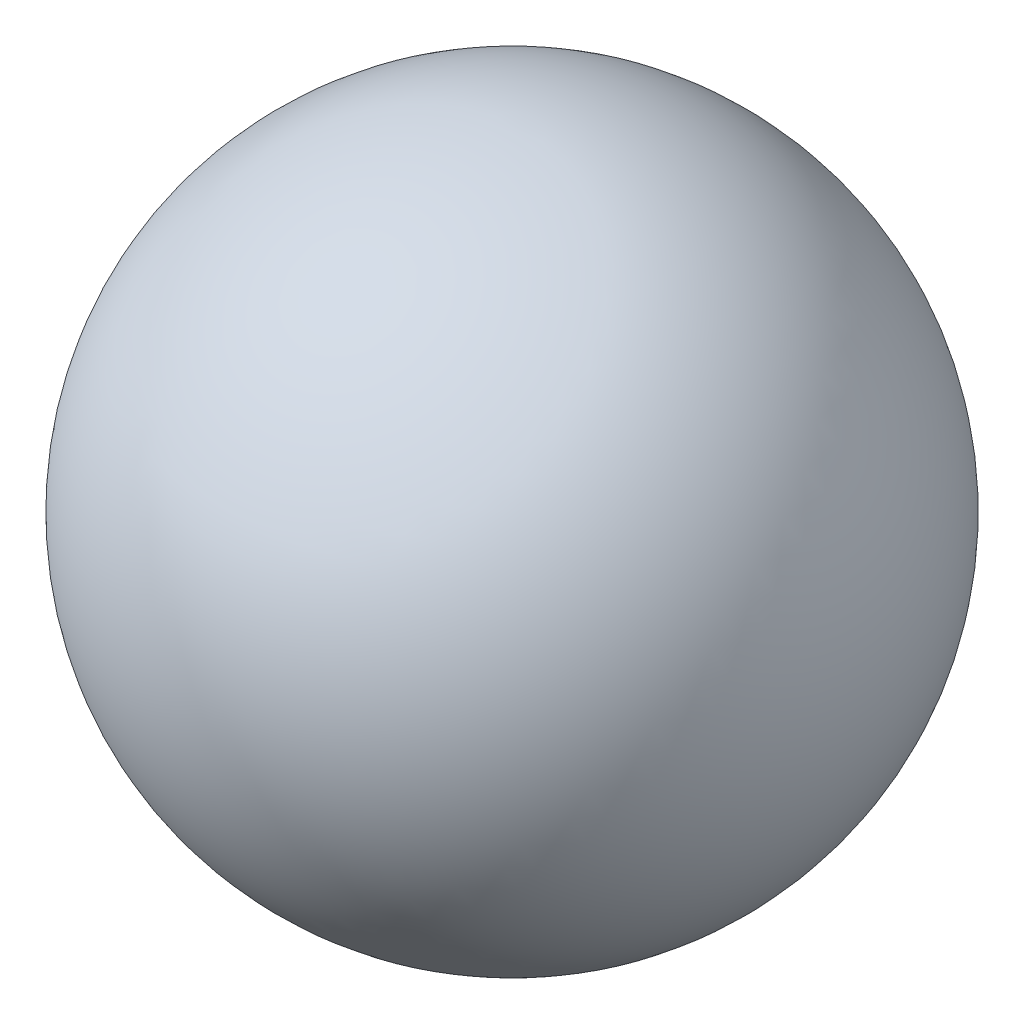
ISO-10303-21;
HEADER;
FILE_DESCRIPTION(('STEP AP214'),'2;1');
FILE_NAME('part.step','',(''),(''),'','','');
FILE_SCHEMA(('AUTOMOTIVE_DESIGN { 1 0 10303 214 1 1 1 1 }'));
ENDSEC;
DATA;
#1=APPLICATION_CONTEXT('core data for automotive mechanical design processes');
#2=APPLICATION_PROTOCOL_DEFINITION('international standard','automotive_design',2000,#1);
#3=PRODUCT_CONTEXT('',#1,'mechanical');
#4=PRODUCT('Part','Part','',(#3));
#5=PRODUCT_RELATED_PRODUCT_CATEGORY('part','',(#4));
#6=PRODUCT_DEFINITION_FORMATION('','',#4);
#7=PRODUCT_DEFINITION_CONTEXT('part definition',#1,'design');
#8=PRODUCT_DEFINITION('design','',#6,#7);
#9=PRODUCT_DEFINITION_SHAPE('','',#8);
#10=(LENGTH_UNIT() NAMED_UNIT(*) SI_UNIT(.MILLI.,.METRE.));
#11=(NAMED_UNIT(*) PLANE_ANGLE_UNIT() SI_UNIT($,.RADIAN.));
#12=(NAMED_UNIT(*) SI_UNIT($,.STERADIAN.) SOLID_ANGLE_UNIT());
#13=UNCERTAINTY_MEASURE_WITH_UNIT(LENGTH_MEASURE(1.E-05),#10,'distance_accuracy_value','');
#14=(GEOMETRIC_REPRESENTATION_CONTEXT(3) GLOBAL_UNCERTAINTY_ASSIGNED_CONTEXT((#13)) GLOBAL_UNIT_ASSIGNED_CONTEXT((#10,
#11,#12)) REPRESENTATION_CONTEXT('',''));
#15=CARTESIAN_POINT('',(0.,0.,0.));
#16=DIRECTION('',(0.,0.,1.));
#17=DIRECTION('',(1.,0.,0.));
#18=AXIS2_PLACEMENT_3D('',#15,#16,#17);
#19=CARTESIAN_POINT('',(0.,0.,0.));
#20=DIRECTION('',(0.,1.,0.));
#21=DIRECTION('',(1.,0.,0.));
#22=AXIS2_PLACEMENT_3D('',#19,#20,#21);
#23=SPHERICAL_SURFACE('',#22,6.75);
#24=CARTESIAN_POINT('',(0.,6.75,0.));
#25=VERTEX_POINT('',#24);
#26=VERTEX_LOOP('',#25);
#27=FACE_BOUND('',#26,.T.);
#28=ADVANCED_FACE('F35',(#27),#23,.T.);
#29=CLOSED_SHELL('',(#28));
#30=MANIFOLD_SOLID_BREP('B2',#29);
#31=ADVANCED_BREP_SHAPE_REPRESENTATION('',(#18,#30),#14);
#32=SHAPE_DEFINITION_REPRESENTATION(#9,#31);
ENDSEC;
END-ISO-10303-21;
